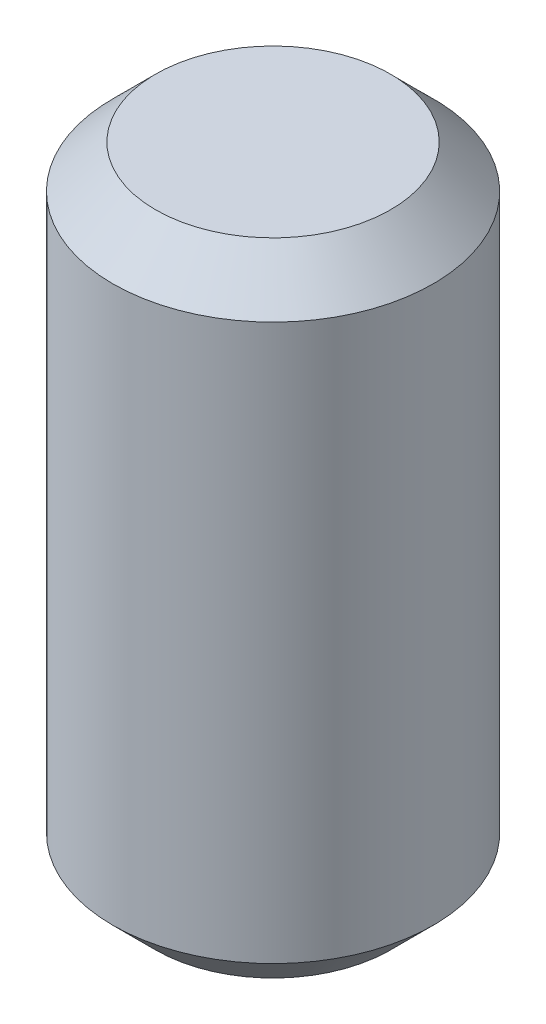
ISO-10303-21;
HEADER;
FILE_DESCRIPTION(('STEP AP214'),'2;1');
FILE_NAME('part.step','',(''),(''),'','','');
FILE_SCHEMA(('AUTOMOTIVE_DESIGN { 1 0 10303 214 1 1 1 1 }'));
ENDSEC;
DATA;
#1=APPLICATION_CONTEXT('core data for automotive mechanical design processes');
#2=APPLICATION_PROTOCOL_DEFINITION('international standard','automotive_design',2000,#1);
#3=PRODUCT_CONTEXT('',#1,'mechanical');
#4=PRODUCT('Part','Part','',(#3));
#5=PRODUCT_RELATED_PRODUCT_CATEGORY('part','',(#4));
#6=PRODUCT_DEFINITION_FORMATION('','',#4);
#7=PRODUCT_DEFINITION_CONTEXT('part definition',#1,'design');
#8=PRODUCT_DEFINITION('design','',#6,#7);
#9=PRODUCT_DEFINITION_SHAPE('','',#8);
#10=(LENGTH_UNIT() NAMED_UNIT(*) SI_UNIT(.MILLI.,.METRE.));
#11=(NAMED_UNIT(*) PLANE_ANGLE_UNIT() SI_UNIT($,.RADIAN.));
#12=(NAMED_UNIT(*) SI_UNIT($,.STERADIAN.) SOLID_ANGLE_UNIT());
#13=UNCERTAINTY_MEASURE_WITH_UNIT(LENGTH_MEASURE(1.E-05),#10,'distance_accuracy_value','');
#14=(GEOMETRIC_REPRESENTATION_CONTEXT(3) GLOBAL_UNCERTAINTY_ASSIGNED_CONTEXT((#13)) GLOBAL_UNIT_ASSIGNED_CONTEXT((#10,
#11,#12)) REPRESENTATION_CONTEXT('',''));
#15=CARTESIAN_POINT('',(0.,0.,0.));
#16=DIRECTION('',(0.,0.,1.));
#17=DIRECTION('',(1.,0.,0.));
#18=AXIS2_PLACEMENT_3D('',#15,#16,#17);
#19=CARTESIAN_POINT('',(0.,15.,0.));
#20=DIRECTION('',(0.,-1.,0.));
#21=DIRECTION('',(0.,0.,-1.00000000000001));
#22=AXIS2_PLACEMENT_3D('',#19,#20,#21);
#23=CYLINDRICAL_SURFACE('',#22,7.5);
#24=CARTESIAN_POINT('',(0.,-13.,0.));
#25=DIRECTION('',(0.,1.,0.));
#26=DIRECTION('',(0.,0.,1.00000000000001));
#27=AXIS2_PLACEMENT_3D('',#24,#25,#26);
#28=CIRCLE('',#27,7.5);
#29=CARTESIAN_POINT('',(0.,-13.,7.50000000000007));
#30=VERTEX_POINT('',#29);
#31=EDGE_CURVE('E52',#30,#30,#28,.T.);
#32=ORIENTED_EDGE('',*,*,#31,.T.);
#33=EDGE_LOOP('',(#32));
#34=FACE_BOUND('',#33,.T.);
#35=CARTESIAN_POINT('',(0.,13.,0.));
#36=DIRECTION('',(0.,1.,0.));
#37=DIRECTION('',(0.,0.,1.00000000000001));
#38=AXIS2_PLACEMENT_3D('',#35,#36,#37);
#39=CIRCLE('',#38,7.5);
#40=CARTESIAN_POINT('',(0.,13.,7.50000000000007));
#41=VERTEX_POINT('',#40);
#42=EDGE_CURVE('E58',#41,#41,#39,.F.);
#43=ORIENTED_EDGE('',*,*,#42,.T.);
#44=EDGE_LOOP('',(#43));
#45=FACE_BOUND('',#44,.T.);
#46=ADVANCED_FACE('F38',(#34,#45),#23,.T.);
#47=CARTESIAN_POINT('',(0.,15.,0.));
#48=DIRECTION('',(0.,1.,0.));
#49=DIRECTION('',(0.,0.,1.00000000000001));
#50=AXIS2_PLACEMENT_3D('',#47,#48,#49);
#51=PLANE('',#50);
#52=CARTESIAN_POINT('',(0.,15.,0.));
#53=DIRECTION('',(0.,1.,0.));
#54=DIRECTION('',(0.,0.,1.00000000000001));
#55=AXIS2_PLACEMENT_3D('',#52,#53,#54);
#56=CIRCLE('',#55,5.5);
#57=CARTESIAN_POINT('',(0.,15.,5.50000000000006));
#58=VERTEX_POINT('',#57);
#59=EDGE_CURVE('E10',#58,#58,#56,.T.);
#60=ORIENTED_EDGE('',*,*,#59,.T.);
#61=EDGE_LOOP('',(#60));
#62=FACE_BOUND('',#61,.T.);
#63=ADVANCED_FACE('F76',(#62),#51,.T.);
#64=CARTESIAN_POINT('',(0.,-15.,0.));
#65=DIRECTION('',(0.,1.,0.));
#66=DIRECTION('',(0.,0.,1.00000000000001));
#67=AXIS2_PLACEMENT_3D('',#64,#65,#66);
#68=PLANE('',#67);
#69=CARTESIAN_POINT('',(0.,-15.,0.));
#70=DIRECTION('',(0.,1.,0.));
#71=DIRECTION('',(0.,0.,1.00000000000001));
#72=AXIS2_PLACEMENT_3D('',#69,#70,#71);
#73=CIRCLE('',#72,5.49999999999999);
#74=CARTESIAN_POINT('',(0.,-15.,5.50000000000004));
#75=VERTEX_POINT('',#74);
#76=EDGE_CURVE('E46',#75,#75,#73,.F.);
#77=ORIENTED_EDGE('',*,*,#76,.T.);
#78=EDGE_LOOP('',(#77));
#79=FACE_BOUND('',#78,.T.);
#80=ADVANCED_FACE('F73',(#79),#68,.F.);
#81=CARTESIAN_POINT('',(0.,-13.,0.));
#82=DIRECTION('',(0.,1.,0.));
#83=DIRECTION('',(0.,0.,1.00000000000001));
#84=AXIS2_PLACEMENT_3D('',#81,#82,#83);
#85=CONICAL_SURFACE('',#84,7.5,0.78539816339745);
#86=ORIENTED_EDGE('',*,*,#76,.F.);
#87=EDGE_LOOP('',(#86));
#88=FACE_BOUND('',#87,.T.);
#89=ORIENTED_EDGE('',*,*,#31,.F.);
#90=EDGE_LOOP('',(#89));
#91=FACE_BOUND('',#90,.T.);
#92=ADVANCED_FACE('F69',(#88,#91),#85,.T.);
#93=CARTESIAN_POINT('',(0.,15.,0.));
#94=DIRECTION('',(0.,-1.,0.));
#95=DIRECTION('',(0.,0.,-1.00000000000001));
#96=AXIS2_PLACEMENT_3D('',#93,#94,#95);
#97=CONICAL_SURFACE('',#96,5.5,0.785398163397446);
#98=ORIENTED_EDGE('',*,*,#42,.F.);
#99=EDGE_LOOP('',(#98));
#100=FACE_BOUND('',#99,.T.);
#101=ORIENTED_EDGE('',*,*,#59,.F.);
#102=EDGE_LOOP('',(#101));
#103=FACE_BOUND('',#102,.T.);
#104=ADVANCED_FACE('F40',(#100,#103),#97,.T.);
#105=CLOSED_SHELL('',(#46,#63,#80,#92,#104));
#106=MANIFOLD_SOLID_BREP('B2',#105);
#107=ADVANCED_BREP_SHAPE_REPRESENTATION('',(#18,#106),#14);
#108=SHAPE_DEFINITION_REPRESENTATION(#9,#107);
ENDSEC;
END-ISO-10303-21;
